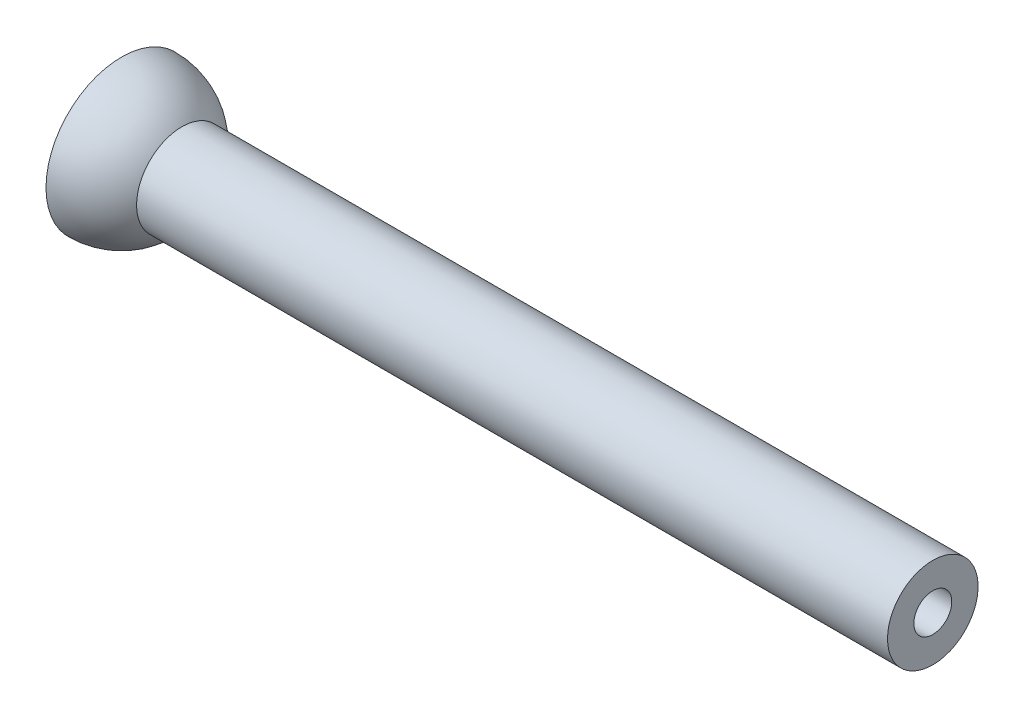
ISO-10303-21;
HEADER;
FILE_DESCRIPTION(('STEP AP214'),'2;1');
FILE_NAME('part.step','',(''),(''),'','','');
FILE_SCHEMA(('AUTOMOTIVE_DESIGN { 1 0 10303 214 1 1 1 1 }'));
ENDSEC;
DATA;
#1=APPLICATION_CONTEXT('core data for automotive mechanical design processes');
#2=APPLICATION_PROTOCOL_DEFINITION('international standard','automotive_design',2000,#1);
#3=PRODUCT_CONTEXT('',#1,'mechanical');
#4=PRODUCT('Part','Part','',(#3));
#5=PRODUCT_RELATED_PRODUCT_CATEGORY('part','',(#4));
#6=PRODUCT_DEFINITION_FORMATION('','',#4);
#7=PRODUCT_DEFINITION_CONTEXT('part definition',#1,'design');
#8=PRODUCT_DEFINITION('design','',#6,#7);
#9=PRODUCT_DEFINITION_SHAPE('','',#8);
#10=(LENGTH_UNIT() NAMED_UNIT(*) SI_UNIT(.MILLI.,.METRE.));
#11=(NAMED_UNIT(*) PLANE_ANGLE_UNIT() SI_UNIT($,.RADIAN.));
#12=(NAMED_UNIT(*) SI_UNIT($,.STERADIAN.) SOLID_ANGLE_UNIT());
#13=UNCERTAINTY_MEASURE_WITH_UNIT(LENGTH_MEASURE(1.E-05),#10,'distance_accuracy_value','');
#14=(GEOMETRIC_REPRESENTATION_CONTEXT(3) GLOBAL_UNCERTAINTY_ASSIGNED_CONTEXT((#13)) GLOBAL_UNIT_ASSIGNED_CONTEXT((#10,
#11,#12)) REPRESENTATION_CONTEXT('',''));
#15=CARTESIAN_POINT('',(0.,0.,0.));
#16=DIRECTION('',(0.,0.,1.));
#17=DIRECTION('',(1.,0.,0.));
#18=AXIS2_PLACEMENT_3D('',#15,#16,#17);
#19=CARTESIAN_POINT('',(0.,0.,0.));
#20=DIRECTION('',(-1.,0.,0.));
#21=DIRECTION('',(0.,0.,-1.));
#22=AXIS2_PLACEMENT_3D('',#19,#20,#21);
#23=SPHERICAL_SURFACE('',#22,10.795);
#24=CARTESIAN_POINT('',(0.,0.,0.));
#25=DIRECTION('',(-1.,0.,0.));
#26=DIRECTION('',(0.,0.,1.));
#27=AXIS2_PLACEMENT_3D('',#24,#25,#26);
#28=CIRCLE('',#27,10.795);
#29=CARTESIAN_POINT('',(0.,0.,10.795));
#30=VERTEX_POINT('',#29);
#31=EDGE_CURVE('E64',#30,#30,#28,.T.);
#32=ORIENTED_EDGE('',*,*,#31,.T.);
#33=EDGE_LOOP('',(#32));
#34=FACE_BOUND('',#33,.T.);
#35=ADVANCED_FACE('F37',(#34),#23,.F.);
#36=CARTESIAN_POINT('',(0.,0.,0.));
#37=DIRECTION('',(-1.,0.,0.));
#38=DIRECTION('',(0.,0.,-1.));
#39=AXIS2_PLACEMENT_3D('',#36,#37,#38);
#40=SPHERICAL_SURFACE('',#39,12.7);
#41=CARTESIAN_POINT('',(12.2919747522557,0.,0.));
#42=DIRECTION('',(-1.,0.,0.));
#43=DIRECTION('',(0.,0.,1.));
#44=AXIS2_PLACEMENT_3D('',#41,#42,#43);
#45=CIRCLE('',#44,3.19333003147328);
#46=CARTESIAN_POINT('',(12.2919747522557,0.,3.19333003147328));
#47=VERTEX_POINT('',#46);
#48=EDGE_CURVE('E10',#47,#47,#45,.T.);
#49=ORIENTED_EDGE('',*,*,#48,.F.);
#50=EDGE_LOOP('',(#49));
#51=FACE_BOUND('',#50,.T.);
#52=ADVANCED_FACE('F95',(#51),#40,.T.);
#53=CARTESIAN_POINT('',(0.,0.,0.));
#54=DIRECTION('',(-1.,0.,0.));
#55=DIRECTION('',(0.,0.,1.));
#56=AXIS2_PLACEMENT_3D('',#53,#54,#55);
#57=CYLINDRICAL_SURFACE('',#56,3.19333003147328);
#58=CARTESIAN_POINT('',(136.525,0.,0.));
#59=DIRECTION('',(-1.,0.,0.));
#60=DIRECTION('',(0.,0.,1.));
#61=AXIS2_PLACEMENT_3D('',#58,#59,#60);
#62=CIRCLE('',#61,3.19333003147328);
#63=CARTESIAN_POINT('',(136.525,0.,3.19333003147328));
#64=VERTEX_POINT('',#63);
#65=EDGE_CURVE('E44',#64,#64,#62,.T.);
#66=ORIENTED_EDGE('',*,*,#65,.F.);
#67=EDGE_LOOP('',(#66));
#68=FACE_BOUND('',#67,.T.);
#69=ORIENTED_EDGE('',*,*,#48,.T.);
#70=EDGE_LOOP('',(#69));
#71=FACE_BOUND('',#70,.T.);
#72=ADVANCED_FACE('F90',(#68,#71),#57,.F.);
#73=CARTESIAN_POINT('',(136.525,0.,-7.62));
#74=DIRECTION('',(-1.,0.,0.));
#75=DIRECTION('',(0.,0.,1.));
#76=AXIS2_PLACEMENT_3D('',#73,#74,#75);
#77=PLANE('',#76);
#78=CARTESIAN_POINT('',(136.525,0.,0.));
#79=DIRECTION('',(-1.,0.,0.));
#80=DIRECTION('',(0.,0.,1.));
#81=AXIS2_PLACEMENT_3D('',#78,#79,#80);
#82=CIRCLE('',#81,7.62);
#83=CARTESIAN_POINT('',(136.525,0.,7.62));
#84=VERTEX_POINT('',#83);
#85=EDGE_CURVE('E49',#84,#84,#82,.T.);
#86=ORIENTED_EDGE('',*,*,#85,.F.);
#87=EDGE_LOOP('',(#86));
#88=FACE_BOUND('',#87,.T.);
#89=ORIENTED_EDGE('',*,*,#65,.T.);
#90=EDGE_LOOP('',(#89));
#91=FACE_BOUND('',#90,.T.);
#92=ADVANCED_FACE('F85',(#88,#91),#77,.F.);
#93=CARTESIAN_POINT('',(0.,0.,0.));
#94=DIRECTION('',(-1.,0.,0.));
#95=DIRECTION('',(0.,0.,1.));
#96=AXIS2_PLACEMENT_3D('',#93,#94,#95);
#97=CYLINDRICAL_SURFACE('',#96,7.62);
#98=CARTESIAN_POINT('',(10.16,0.,0.));
#99=DIRECTION('',(-1.,0.,0.));
#100=DIRECTION('',(0.,0.,1.));
#101=AXIS2_PLACEMENT_3D('',#98,#99,#100);
#102=CIRCLE('',#101,7.62);
#103=CARTESIAN_POINT('',(10.16,0.,7.62));
#104=VERTEX_POINT('',#103);
#105=EDGE_CURVE('E54',#104,#104,#102,.T.);
#106=ORIENTED_EDGE('',*,*,#105,.F.);
#107=EDGE_LOOP('',(#106));
#108=FACE_BOUND('',#107,.T.);
#109=ORIENTED_EDGE('',*,*,#85,.T.);
#110=EDGE_LOOP('',(#109));
#111=FACE_BOUND('',#110,.T.);
#112=ADVANCED_FACE('F79',(#108,#111),#97,.T.);
#113=CARTESIAN_POINT('',(0.,0.,0.));
#114=DIRECTION('',(-1.,0.,0.));
#115=DIRECTION('',(0.,0.,-1.));
#116=AXIS2_PLACEMENT_3D('',#113,#114,#115);
#117=SPHERICAL_SURFACE('',#116,12.7);
#118=CARTESIAN_POINT('',(0.,0.,0.));
#119=DIRECTION('',(-1.,0.,0.));
#120=DIRECTION('',(0.,0.,1.));
#121=AXIS2_PLACEMENT_3D('',#118,#119,#120);
#122=CIRCLE('',#121,12.7);
#123=CARTESIAN_POINT('',(0.,0.,12.7));
#124=VERTEX_POINT('',#123);
#125=EDGE_CURVE('E60',#124,#124,#122,.T.);
#126=ORIENTED_EDGE('',*,*,#125,.F.);
#127=EDGE_LOOP('',(#126));
#128=FACE_BOUND('',#127,.T.);
#129=ORIENTED_EDGE('',*,*,#105,.T.);
#130=EDGE_LOOP('',(#129));
#131=FACE_BOUND('',#130,.T.);
#132=ADVANCED_FACE('F73',(#128,#131),#117,.T.);
#133=CARTESIAN_POINT('',(0.,0.,-12.7));
#134=DIRECTION('',(1.,0.,0.));
#135=DIRECTION('',(0.,0.,-1.));
#136=AXIS2_PLACEMENT_3D('',#133,#134,#135);
#137=PLANE('',#136);
#138=ORIENTED_EDGE('',*,*,#31,.F.);
#139=EDGE_LOOP('',(#138));
#140=FACE_BOUND('',#139,.T.);
#141=ORIENTED_EDGE('',*,*,#125,.T.);
#142=EDGE_LOOP('',(#141));
#143=FACE_BOUND('',#142,.T.);
#144=ADVANCED_FACE('F70',(#140,#143),#137,.F.);
#145=CLOSED_SHELL('',(#35,#52,#72,#92,#112,#132,#144));
#146=MANIFOLD_SOLID_BREP('B2',#145);
#147=ADVANCED_BREP_SHAPE_REPRESENTATION('',(#18,#146),#14);
#148=SHAPE_DEFINITION_REPRESENTATION(#9,#147);
ENDSEC;
END-ISO-10303-21;
